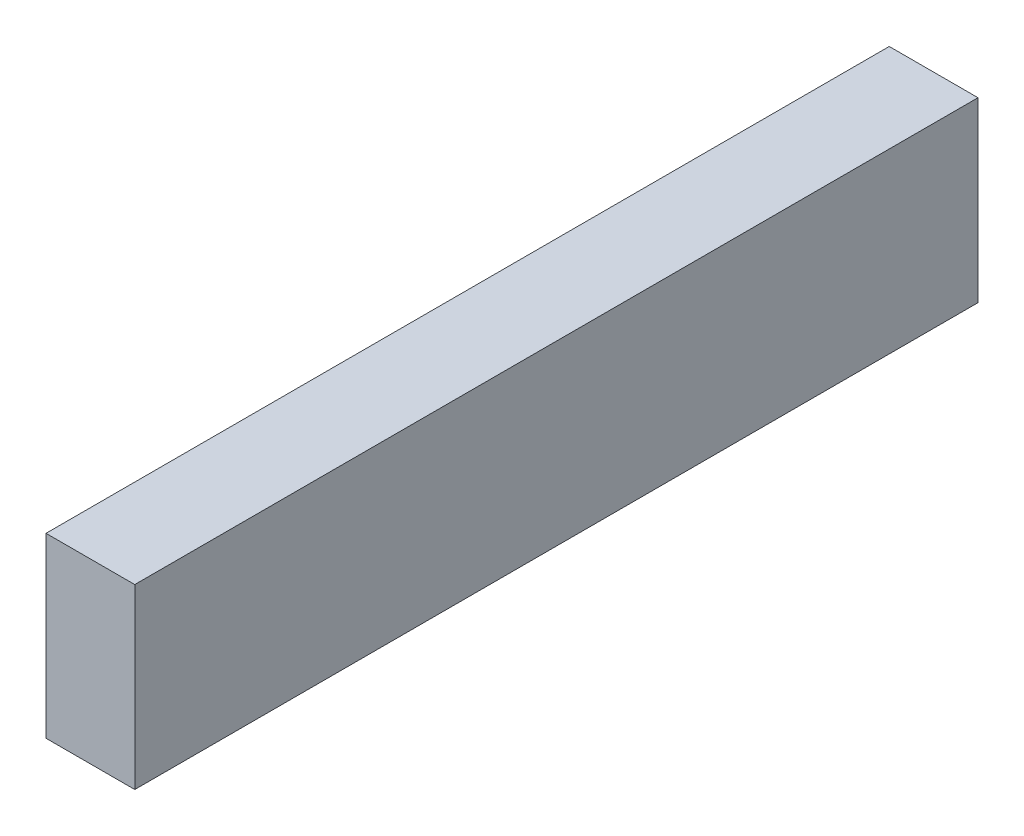
ISO-10303-21;
HEADER;
FILE_DESCRIPTION(('STEP AP214'),'2;1');
FILE_NAME('part.step','',(''),(''),'','','');
FILE_SCHEMA(('AUTOMOTIVE_DESIGN { 1 0 10303 214 1 1 1 1 }'));
ENDSEC;
DATA;
#1=APPLICATION_CONTEXT('core data for automotive mechanical design processes');
#2=APPLICATION_PROTOCOL_DEFINITION('international standard','automotive_design',2000,#1);
#3=PRODUCT_CONTEXT('',#1,'mechanical');
#4=PRODUCT('Part','Part','',(#3));
#5=PRODUCT_RELATED_PRODUCT_CATEGORY('part','',(#4));
#6=PRODUCT_DEFINITION_FORMATION('','',#4);
#7=PRODUCT_DEFINITION_CONTEXT('part definition',#1,'design');
#8=PRODUCT_DEFINITION('design','',#6,#7);
#9=PRODUCT_DEFINITION_SHAPE('','',#8);
#10=(LENGTH_UNIT() NAMED_UNIT(*) SI_UNIT(.MILLI.,.METRE.));
#11=(NAMED_UNIT(*) PLANE_ANGLE_UNIT() SI_UNIT($,.RADIAN.));
#12=(NAMED_UNIT(*) SI_UNIT($,.STERADIAN.) SOLID_ANGLE_UNIT());
#13=UNCERTAINTY_MEASURE_WITH_UNIT(LENGTH_MEASURE(1.E-05),#10,'distance_accuracy_value','');
#14=(GEOMETRIC_REPRESENTATION_CONTEXT(3) GLOBAL_UNCERTAINTY_ASSIGNED_CONTEXT((#13)) GLOBAL_UNIT_ASSIGNED_CONTEXT((#10,
#11,#12)) REPRESENTATION_CONTEXT('',''));
#15=CARTESIAN_POINT('',(0.,0.,0.));
#16=DIRECTION('',(0.,0.,1.));
#17=DIRECTION('',(1.,0.,0.));
#18=AXIS2_PLACEMENT_3D('',#15,#16,#17);
#19=CARTESIAN_POINT('',(142.5,-17.,-75.));
#20=DIRECTION('',(-1.,0.,0.));
#21=DIRECTION('',(0.,0.,1.));
#22=AXIS2_PLACEMENT_3D('',#19,#20,#21);
#23=PLANE('',#22);
#24=DIRECTION('',(0.,0.,1.));
#25=VECTOR('',#24,1.);
#26=CARTESIAN_POINT('',(142.5,3.,-75.));
#27=LINE('',#26,#25);
#28=CARTESIAN_POINT('',(142.5,3.,-75.));
#29=VERTEX_POINT('',#28);
#30=CARTESIAN_POINT('',(142.5,3.,20.));
#31=VERTEX_POINT('',#30);
#32=EDGE_CURVE('E96',#29,#31,#27,.T.);
#33=ORIENTED_EDGE('',*,*,#32,.T.);
#34=DIRECTION('',(0.,1.,0.));
#35=VECTOR('',#34,1.);
#36=CARTESIAN_POINT('',(142.5,-17.,20.));
#37=LINE('',#36,#35);
#38=CARTESIAN_POINT('',(142.5,-17.,20.));
#39=VERTEX_POINT('',#38);
#40=EDGE_CURVE('E11',#39,#31,#37,.T.);
#41=ORIENTED_EDGE('',*,*,#40,.F.);
#42=DIRECTION('',(0.,0.,1.));
#43=VECTOR('',#42,1.);
#44=CARTESIAN_POINT('',(142.5,-17.,-75.));
#45=LINE('',#44,#43);
#46=CARTESIAN_POINT('',(142.5,-17.,-75.));
#47=VERTEX_POINT('',#46);
#48=EDGE_CURVE('E84',#47,#39,#45,.T.);
#49=ORIENTED_EDGE('',*,*,#48,.F.);
#50=DIRECTION('',(0.,1.,0.));
#51=VECTOR('',#50,1.);
#52=CARTESIAN_POINT('',(142.5,-17.,-75.));
#53=LINE('',#52,#51);
#54=EDGE_CURVE('E92',#47,#29,#53,.T.);
#55=ORIENTED_EDGE('',*,*,#54,.T.);
#56=EDGE_LOOP('',(#33,#41,#49,#55));
#57=FACE_BOUND('',#56,.T.);
#58=ADVANCED_FACE('F33',(#57),#23,.F.);
#59=CARTESIAN_POINT('',(142.5,-17.,20.));
#60=DIRECTION('',(0.,0.,-1.));
#61=DIRECTION('',(-1.,0.,0.));
#62=AXIS2_PLACEMENT_3D('',#59,#60,#61);
#63=PLANE('',#62);
#64=DIRECTION('',(-1.,0.,0.));
#65=VECTOR('',#64,1.);
#66=CARTESIAN_POINT('',(142.5,3.,20.));
#67=LINE('',#66,#65);
#68=CARTESIAN_POINT('',(132.5,3.,20.));
#69=VERTEX_POINT('',#68);
#70=EDGE_CURVE('E88',#31,#69,#67,.T.);
#71=ORIENTED_EDGE('',*,*,#70,.T.);
#72=DIRECTION('',(0.,1.,0.));
#73=VECTOR('',#72,1.);
#74=CARTESIAN_POINT('',(132.5,-17.,20.));
#75=LINE('',#74,#73);
#76=CARTESIAN_POINT('',(132.5,-17.,20.));
#77=VERTEX_POINT('',#76);
#78=EDGE_CURVE('E41',#77,#69,#75,.T.);
#79=ORIENTED_EDGE('',*,*,#78,.F.);
#80=DIRECTION('',(-1.,0.,0.));
#81=VECTOR('',#80,1.);
#82=CARTESIAN_POINT('',(142.5,-17.,20.));
#83=LINE('',#82,#81);
#84=EDGE_CURVE('E79',#39,#77,#83,.T.);
#85=ORIENTED_EDGE('',*,*,#84,.F.);
#86=ORIENTED_EDGE('',*,*,#40,.T.);
#87=EDGE_LOOP('',(#71,#79,#85,#86));
#88=FACE_BOUND('',#87,.T.);
#89=ADVANCED_FACE('F87',(#88),#63,.F.);
#90=CARTESIAN_POINT('',(132.5,-17.,-75.));
#91=DIRECTION('',(1.,0.,0.));
#92=DIRECTION('',(0.,0.,-1.));
#93=AXIS2_PLACEMENT_3D('',#90,#91,#92);
#94=PLANE('',#93);
#95=DIRECTION('',(0.,0.,-1.));
#96=VECTOR('',#95,1.);
#97=CARTESIAN_POINT('',(132.5,3.,-75.));
#98=LINE('',#97,#96);
#99=CARTESIAN_POINT('',(132.5,3.,-75.));
#100=VERTEX_POINT('',#99);
#101=EDGE_CURVE('E66',#69,#100,#98,.T.);
#102=ORIENTED_EDGE('',*,*,#101,.T.);
#103=DIRECTION('',(0.,1.,0.));
#104=VECTOR('',#103,1.);
#105=CARTESIAN_POINT('',(132.5,-17.,-75.));
#106=LINE('',#105,#104);
#107=CARTESIAN_POINT('',(132.5,-17.,-75.));
#108=VERTEX_POINT('',#107);
#109=EDGE_CURVE('E89',#108,#100,#106,.T.);
#110=ORIENTED_EDGE('',*,*,#109,.F.);
#111=DIRECTION('',(0.,0.,-1.));
#112=VECTOR('',#111,1.);
#113=CARTESIAN_POINT('',(132.5,-17.,-75.));
#114=LINE('',#113,#112);
#115=EDGE_CURVE('E82',#77,#108,#114,.T.);
#116=ORIENTED_EDGE('',*,*,#115,.F.);
#117=ORIENTED_EDGE('',*,*,#78,.T.);
#118=EDGE_LOOP('',(#102,#110,#116,#117));
#119=FACE_BOUND('',#118,.T.);
#120=ADVANCED_FACE('F90',(#119),#94,.F.);
#121=CARTESIAN_POINT('',(142.5,-17.,-75.));
#122=DIRECTION('',(0.,0.,1.));
#123=DIRECTION('',(1.,0.,0.));
#124=AXIS2_PLACEMENT_3D('',#121,#122,#123);
#125=PLANE('',#124);
#126=DIRECTION('',(1.,0.,0.));
#127=VECTOR('',#126,1.);
#128=CARTESIAN_POINT('',(142.5,3.,-75.));
#129=LINE('',#128,#127);
#130=EDGE_CURVE('E72',#100,#29,#129,.T.);
#131=ORIENTED_EDGE('',*,*,#130,.T.);
#132=ORIENTED_EDGE('',*,*,#54,.F.);
#133=DIRECTION('',(1.,0.,0.));
#134=VECTOR('',#133,1.);
#135=CARTESIAN_POINT('',(142.5,-17.,-75.));
#136=LINE('',#135,#134);
#137=EDGE_CURVE('E49',#108,#47,#136,.T.);
#138=ORIENTED_EDGE('',*,*,#137,.F.);
#139=ORIENTED_EDGE('',*,*,#109,.T.);
#140=EDGE_LOOP('',(#131,#132,#138,#139));
#141=FACE_BOUND('',#140,.T.);
#142=ADVANCED_FACE('F103',(#141),#125,.F.);
#143=CARTESIAN_POINT('',(142.5,-17.,20.));
#144=DIRECTION('',(0.,-1.,0.));
#145=DIRECTION('',(0.,0.,-1.));
#146=AXIS2_PLACEMENT_3D('',#143,#144,#145);
#147=PLANE('',#146);
#148=ORIENTED_EDGE('',*,*,#48,.T.);
#149=ORIENTED_EDGE('',*,*,#84,.T.);
#150=ORIENTED_EDGE('',*,*,#115,.T.);
#151=ORIENTED_EDGE('',*,*,#137,.T.);
#152=EDGE_LOOP('',(#148,#149,#150,#151));
#153=FACE_BOUND('',#152,.T.);
#154=ADVANCED_FACE('F80',(#153),#147,.T.);
#155=CARTESIAN_POINT('',(142.5,3.,20.));
#156=DIRECTION('',(0.,-1.,0.));
#157=DIRECTION('',(0.,0.,-1.));
#158=AXIS2_PLACEMENT_3D('',#155,#156,#157);
#159=PLANE('',#158);
#160=ORIENTED_EDGE('',*,*,#32,.F.);
#161=ORIENTED_EDGE('',*,*,#130,.F.);
#162=ORIENTED_EDGE('',*,*,#101,.F.);
#163=ORIENTED_EDGE('',*,*,#70,.F.);
#164=EDGE_LOOP('',(#160,#161,#162,#163));
#165=FACE_BOUND('',#164,.T.);
#166=ADVANCED_FACE('F106',(#165),#159,.F.);
#167=CLOSED_SHELL('',(#58,#89,#120,#142,#154,#166));
#168=MANIFOLD_SOLID_BREP('B2',#167);
#169=ADVANCED_BREP_SHAPE_REPRESENTATION('',(#18,#168),#14);
#170=SHAPE_DEFINITION_REPRESENTATION(#9,#169);
ENDSEC;
END-ISO-10303-21;
